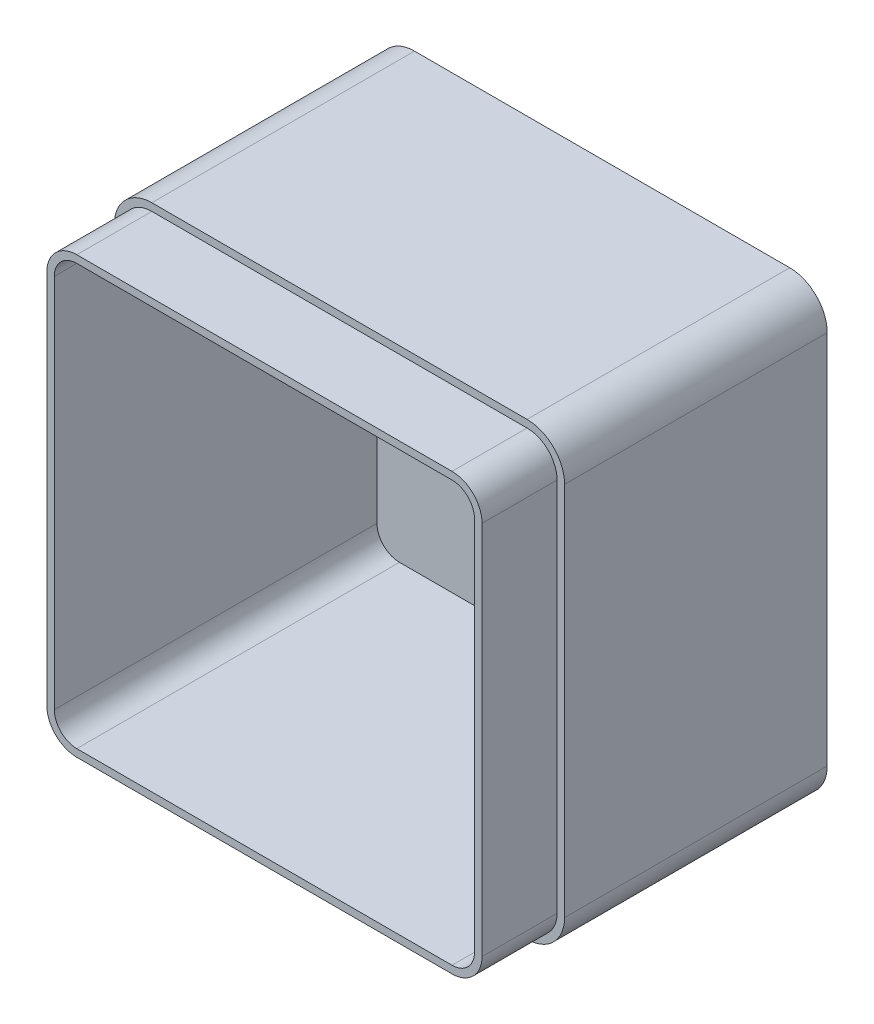
ISO-10303-21;
HEADER;
FILE_DESCRIPTION(('STEP AP214'),'2;1');
FILE_NAME('part.step','',(''),(''),'','','');
FILE_SCHEMA(('AUTOMOTIVE_DESIGN { 1 0 10303 214 1 1 1 1 }'));
ENDSEC;
DATA;
#1=APPLICATION_CONTEXT('core data for automotive mechanical design processes');
#2=APPLICATION_PROTOCOL_DEFINITION('international standard','automotive_design',2000,#1);
#3=PRODUCT_CONTEXT('',#1,'mechanical');
#4=PRODUCT('Part','Part','',(#3));
#5=PRODUCT_RELATED_PRODUCT_CATEGORY('part','',(#4));
#6=PRODUCT_DEFINITION_FORMATION('','',#4);
#7=PRODUCT_DEFINITION_CONTEXT('part definition',#1,'design');
#8=PRODUCT_DEFINITION('design','',#6,#7);
#9=PRODUCT_DEFINITION_SHAPE('','',#8);
#10=(LENGTH_UNIT() NAMED_UNIT(*) SI_UNIT(.MILLI.,.METRE.));
#11=(NAMED_UNIT(*) PLANE_ANGLE_UNIT() SI_UNIT($,.RADIAN.));
#12=(NAMED_UNIT(*) SI_UNIT($,.STERADIAN.) SOLID_ANGLE_UNIT());
#13=UNCERTAINTY_MEASURE_WITH_UNIT(LENGTH_MEASURE(1.E-05),#10,'distance_accuracy_value','');
#14=(GEOMETRIC_REPRESENTATION_CONTEXT(3) GLOBAL_UNCERTAINTY_ASSIGNED_CONTEXT((#13)) GLOBAL_UNIT_ASSIGNED_CONTEXT((#10,
#11,#12)) REPRESENTATION_CONTEXT('',''));
#15=CARTESIAN_POINT('',(0.,0.,0.));
#16=DIRECTION('',(0.,0.,1.));
#17=DIRECTION('',(1.,0.,0.));
#18=AXIS2_PLACEMENT_3D('',#15,#16,#17);
#19=CARTESIAN_POINT('',(0.,0.,90.));
#20=DIRECTION('',(0.,0.,-1.));
#21=DIRECTION('',(-1.,0.,0.));
#22=AXIS2_PLACEMENT_3D('',#19,#20,#21);
#23=PLANE('',#22);
#24=DIRECTION('',(0.,-1.,0.));
#25=VECTOR('',#24,1.);
#26=CARTESIAN_POINT('',(4.,0.,90.));
#27=LINE('',#26,#25);
#28=CARTESIAN_POINT('',(4.,110.,90.));
#29=VERTEX_POINT('',#28);
#30=CARTESIAN_POINT('',(4.,9.99999999999999,90.));
#31=VERTEX_POINT('',#30);
#32=EDGE_CURVE('E304',#29,#31,#27,.T.);
#33=ORIENTED_EDGE('',*,*,#32,.F.);
#34=CARTESIAN_POINT('',(10.,110.,90.));
#35=DIRECTION('',(0.,0.,-1.));
#36=DIRECTION('',(-1.,0.,0.));
#37=AXIS2_PLACEMENT_3D('',#34,#35,#36);
#38=CIRCLE('',#37,6.);
#39=CARTESIAN_POINT('',(9.99999999999999,116.,90.));
#40=VERTEX_POINT('',#39);
#41=EDGE_CURVE('E287',#40,#29,#38,.F.);
#42=ORIENTED_EDGE('',*,*,#41,.F.);
#43=DIRECTION('',(-1.,0.,0.));
#44=VECTOR('',#43,1.);
#45=CARTESIAN_POINT('',(0.,116.,90.));
#46=LINE('',#45,#44);
#47=CARTESIAN_POINT('',(110.,116.,90.));
#48=VERTEX_POINT('',#47);
#49=EDGE_CURVE('E313',#48,#40,#46,.T.);
#50=ORIENTED_EDGE('',*,*,#49,.F.);
#51=CARTESIAN_POINT('',(110.,110.,90.));
#52=DIRECTION('',(0.,0.,-1.));
#53=DIRECTION('',(-1.,0.,0.));
#54=AXIS2_PLACEMENT_3D('',#51,#52,#53);
#55=CIRCLE('',#54,6.);
#56=CARTESIAN_POINT('',(116.,110.,90.));
#57=VERTEX_POINT('',#56);
#58=EDGE_CURVE('E336',#57,#48,#55,.F.);
#59=ORIENTED_EDGE('',*,*,#58,.F.);
#60=DIRECTION('',(0.,1.,0.));
#61=VECTOR('',#60,1.);
#62=CARTESIAN_POINT('',(116.,0.,90.));
#63=LINE('',#62,#61);
#64=CARTESIAN_POINT('',(116.,9.99999999999999,90.));
#65=VERTEX_POINT('',#64);
#66=EDGE_CURVE('E334',#65,#57,#63,.T.);
#67=ORIENTED_EDGE('',*,*,#66,.F.);
#68=CARTESIAN_POINT('',(110.,10.,90.));
#69=DIRECTION('',(0.,0.,-1.));
#70=DIRECTION('',(-1.,0.,0.));
#71=AXIS2_PLACEMENT_3D('',#68,#69,#70);
#72=CIRCLE('',#71,6.);
#73=CARTESIAN_POINT('',(110.,4.,90.));
#74=VERTEX_POINT('',#73);
#75=EDGE_CURVE('E331',#74,#65,#72,.F.);
#76=ORIENTED_EDGE('',*,*,#75,.F.);
#77=DIRECTION('',(1.,0.,0.));
#78=VECTOR('',#77,1.);
#79=CARTESIAN_POINT('',(0.,4.,90.));
#80=LINE('',#79,#78);
#81=CARTESIAN_POINT('',(9.99999999999999,4.,90.));
#82=VERTEX_POINT('',#81);
#83=EDGE_CURVE('E329',#82,#74,#80,.T.);
#84=ORIENTED_EDGE('',*,*,#83,.F.);
#85=CARTESIAN_POINT('',(10.,10.,90.));
#86=DIRECTION('',(0.,0.,-1.));
#87=DIRECTION('',(-1.,0.,0.));
#88=AXIS2_PLACEMENT_3D('',#85,#86,#87);
#89=CIRCLE('',#88,6.);
#90=EDGE_CURVE('E320',#31,#82,#89,.F.);
#91=ORIENTED_EDGE('',*,*,#90,.F.);
#92=EDGE_LOOP('',(#33,#42,#50,#59,#67,#76,#84,#91));
#93=FACE_BOUND('',#92,.T.);
#94=CARTESIAN_POINT('',(10.,110.,90.));
#95=DIRECTION('',(0.,0.,1.));
#96=DIRECTION('',(1.,0.,0.));
#97=AXIS2_PLACEMENT_3D('',#94,#95,#96);
#98=CIRCLE('',#97,8.);
#99=CARTESIAN_POINT('',(9.99999999999999,118.,90.));
#100=VERTEX_POINT('',#99);
#101=CARTESIAN_POINT('',(2.,110.,90.));
#102=VERTEX_POINT('',#101);
#103=EDGE_CURVE('E239',#100,#102,#98,.T.);
#104=ORIENTED_EDGE('',*,*,#103,.T.);
#105=DIRECTION('',(0.,-1.,0.));
#106=VECTOR('',#105,1.);
#107=CARTESIAN_POINT('',(2.,110.,90.));
#108=LINE('',#107,#106);
#109=CARTESIAN_POINT('',(2.,9.99999999999999,90.));
#110=VERTEX_POINT('',#109);
#111=EDGE_CURVE('E199',#102,#110,#108,.T.);
#112=ORIENTED_EDGE('',*,*,#111,.T.);
#113=CARTESIAN_POINT('',(10.,10.,90.));
#114=DIRECTION('',(0.,0.,1.));
#115=DIRECTION('',(1.,0.,0.));
#116=AXIS2_PLACEMENT_3D('',#113,#114,#115);
#117=CIRCLE('',#116,8.);
#118=CARTESIAN_POINT('',(9.99999999999999,2.,90.));
#119=VERTEX_POINT('',#118);
#120=EDGE_CURVE('E48',#110,#119,#117,.T.);
#121=ORIENTED_EDGE('',*,*,#120,.T.);
#122=DIRECTION('',(1.,0.,0.));
#123=VECTOR('',#122,1.);
#124=CARTESIAN_POINT('',(10.,2.,90.));
#125=LINE('',#124,#123);
#126=CARTESIAN_POINT('',(110.,2.,90.));
#127=VERTEX_POINT('',#126);
#128=EDGE_CURVE('E243',#119,#127,#125,.T.);
#129=ORIENTED_EDGE('',*,*,#128,.T.);
#130=CARTESIAN_POINT('',(110.,10.,90.));
#131=DIRECTION('',(0.,0.,1.));
#132=DIRECTION('',(1.,0.,0.));
#133=AXIS2_PLACEMENT_3D('',#130,#131,#132);
#134=CIRCLE('',#133,7.99999999999999);
#135=CARTESIAN_POINT('',(118.,10.,90.));
#136=VERTEX_POINT('',#135);
#137=EDGE_CURVE('E246',#127,#136,#134,.T.);
#138=ORIENTED_EDGE('',*,*,#137,.T.);
#139=DIRECTION('',(0.,1.,0.));
#140=VECTOR('',#139,1.);
#141=CARTESIAN_POINT('',(118.,10.,90.));
#142=LINE('',#141,#140);
#143=CARTESIAN_POINT('',(118.,110.,90.));
#144=VERTEX_POINT('',#143);
#145=EDGE_CURVE('E249',#136,#144,#142,.T.);
#146=ORIENTED_EDGE('',*,*,#145,.T.);
#147=CARTESIAN_POINT('',(110.,110.,90.));
#148=DIRECTION('',(0.,0.,1.));
#149=DIRECTION('',(1.,0.,0.));
#150=AXIS2_PLACEMENT_3D('',#147,#148,#149);
#151=CIRCLE('',#150,7.99999999999999);
#152=CARTESIAN_POINT('',(110.,118.,90.));
#153=VERTEX_POINT('',#152);
#154=EDGE_CURVE('E222',#144,#153,#151,.T.);
#155=ORIENTED_EDGE('',*,*,#154,.T.);
#156=DIRECTION('',(-1.,0.,0.));
#157=VECTOR('',#156,1.);
#158=CARTESIAN_POINT('',(110.,118.,90.));
#159=LINE('',#158,#157);
#160=EDGE_CURVE('E219',#153,#100,#159,.T.);
#161=ORIENTED_EDGE('',*,*,#160,.T.);
#162=EDGE_LOOP('',(#104,#112,#121,#129,#138,#146,#155,#161));
#163=FACE_BOUND('',#162,.T.);
#164=ADVANCED_FACE('F33',(#93,#163),#23,.F.);
#165=CARTESIAN_POINT('',(4.,0.,90.));
#166=DIRECTION('',(1.,0.,0.));
#167=DIRECTION('',(0.,0.,-1.));
#168=AXIS2_PLACEMENT_3D('',#165,#166,#167);
#169=PLANE('',#168);
#170=DIRECTION('',(0.,-1.,0.));
#171=VECTOR('',#170,1.);
#172=CARTESIAN_POINT('',(4.,0.,4.));
#173=LINE('',#172,#171);
#174=CARTESIAN_POINT('',(4.,110.,4.));
#175=VERTEX_POINT('',#174);
#176=CARTESIAN_POINT('',(4.,9.99999999999999,4.));
#177=VERTEX_POINT('',#176);
#178=EDGE_CURVE('E281',#175,#177,#173,.T.);
#179=ORIENTED_EDGE('',*,*,#178,.F.);
#180=DIRECTION('',(0.,0.,-1.));
#181=VECTOR('',#180,1.);
#182=CARTESIAN_POINT('',(4.,110.,90.));
#183=LINE('',#182,#181);
#184=EDGE_CURVE('E288',#29,#175,#183,.T.);
#185=ORIENTED_EDGE('',*,*,#184,.F.);
#186=ORIENTED_EDGE('',*,*,#32,.T.);
#187=DIRECTION('',(0.,0.,-1.));
#188=VECTOR('',#187,1.);
#189=CARTESIAN_POINT('',(4.,9.99999999999999,90.));
#190=LINE('',#189,#188);
#191=EDGE_CURVE('E285',#177,#31,#190,.F.);
#192=ORIENTED_EDGE('',*,*,#191,.F.);
#193=EDGE_LOOP('',(#179,#185,#186,#192));
#194=FACE_BOUND('',#193,.T.);
#195=ADVANCED_FACE('F427',(#194),#169,.T.);
#196=CARTESIAN_POINT('',(0.,4.,90.));
#197=DIRECTION('',(0.,1.,0.));
#198=DIRECTION('',(0.,0.,1.));
#199=AXIS2_PLACEMENT_3D('',#196,#197,#198);
#200=PLANE('',#199);
#201=ORIENTED_EDGE('',*,*,#83,.T.);
#202=DIRECTION('',(0.,0.,1.));
#203=VECTOR('',#202,1.);
#204=CARTESIAN_POINT('',(110.,4.,90.));
#205=LINE('',#204,#203);
#206=CARTESIAN_POINT('',(110.,4.,4.));
#207=VERTEX_POINT('',#206);
#208=EDGE_CURVE('E311',#207,#74,#205,.T.);
#209=ORIENTED_EDGE('',*,*,#208,.F.);
#210=DIRECTION('',(1.,0.,0.));
#211=VECTOR('',#210,1.);
#212=CARTESIAN_POINT('',(0.,4.,4.));
#213=LINE('',#212,#211);
#214=CARTESIAN_POINT('',(9.99999999999999,4.,4.));
#215=VERTEX_POINT('',#214);
#216=EDGE_CURVE('E284',#215,#207,#213,.T.);
#217=ORIENTED_EDGE('',*,*,#216,.F.);
#218=DIRECTION('',(0.,0.,1.));
#219=VECTOR('',#218,1.);
#220=CARTESIAN_POINT('',(9.99999999999999,4.,90.));
#221=LINE('',#220,#219);
#222=EDGE_CURVE('E300',#82,#215,#221,.F.);
#223=ORIENTED_EDGE('',*,*,#222,.F.);
#224=EDGE_LOOP('',(#201,#209,#217,#223));
#225=FACE_BOUND('',#224,.T.);
#226=ADVANCED_FACE('F433',(#225),#200,.T.);
#227=CARTESIAN_POINT('',(116.,0.,90.));
#228=DIRECTION('',(-1.,0.,0.));
#229=DIRECTION('',(0.,0.,1.));
#230=AXIS2_PLACEMENT_3D('',#227,#228,#229);
#231=PLANE('',#230);
#232=ORIENTED_EDGE('',*,*,#66,.T.);
#233=DIRECTION('',(0.,0.,1.));
#234=VECTOR('',#233,1.);
#235=CARTESIAN_POINT('',(116.,110.,90.));
#236=LINE('',#235,#234);
#237=CARTESIAN_POINT('',(116.,110.,4.));
#238=VERTEX_POINT('',#237);
#239=EDGE_CURVE('E318',#238,#57,#236,.T.);
#240=ORIENTED_EDGE('',*,*,#239,.F.);
#241=DIRECTION('',(0.,1.,0.));
#242=VECTOR('',#241,1.);
#243=CARTESIAN_POINT('',(116.,0.,4.));
#244=LINE('',#243,#242);
#245=CARTESIAN_POINT('',(116.,9.99999999999999,4.));
#246=VERTEX_POINT('',#245);
#247=EDGE_CURVE('E294',#246,#238,#244,.T.);
#248=ORIENTED_EDGE('',*,*,#247,.F.);
#249=DIRECTION('',(0.,0.,1.));
#250=VECTOR('',#249,1.);
#251=CARTESIAN_POINT('',(116.,9.99999999999999,90.));
#252=LINE('',#251,#250);
#253=EDGE_CURVE('E314',#65,#246,#252,.F.);
#254=ORIENTED_EDGE('',*,*,#253,.F.);
#255=EDGE_LOOP('',(#232,#240,#248,#254));
#256=FACE_BOUND('',#255,.T.);
#257=ADVANCED_FACE('F462',(#256),#231,.T.);
#258=CARTESIAN_POINT('',(0.,116.,90.));
#259=DIRECTION('',(0.,-1.,0.));
#260=DIRECTION('',(0.,0.,-1.));
#261=AXIS2_PLACEMENT_3D('',#258,#259,#260);
#262=PLANE('',#261);
#263=ORIENTED_EDGE('',*,*,#49,.T.);
#264=DIRECTION('',(0.,0.,-1.));
#265=VECTOR('',#264,1.);
#266=CARTESIAN_POINT('',(9.99999999999999,116.,90.));
#267=LINE('',#266,#265);
#268=CARTESIAN_POINT('',(9.99999999999999,116.,4.));
#269=VERTEX_POINT('',#268);
#270=EDGE_CURVE('E317',#269,#40,#267,.F.);
#271=ORIENTED_EDGE('',*,*,#270,.F.);
#272=DIRECTION('',(-1.,0.,0.));
#273=VECTOR('',#272,1.);
#274=CARTESIAN_POINT('',(0.,116.,4.));
#275=LINE('',#274,#273);
#276=CARTESIAN_POINT('',(110.,116.,4.));
#277=VERTEX_POINT('',#276);
#278=EDGE_CURVE('E301',#277,#269,#275,.T.);
#279=ORIENTED_EDGE('',*,*,#278,.F.);
#280=DIRECTION('',(0.,0.,-1.));
#281=VECTOR('',#280,1.);
#282=CARTESIAN_POINT('',(110.,116.,90.));
#283=LINE('',#282,#281);
#284=EDGE_CURVE('E321',#48,#277,#283,.T.);
#285=ORIENTED_EDGE('',*,*,#284,.F.);
#286=EDGE_LOOP('',(#263,#271,#279,#285));
#287=FACE_BOUND('',#286,.T.);
#288=ADVANCED_FACE('F458',(#287),#262,.T.);
#289=CARTESIAN_POINT('',(0.,0.,4.));
#290=DIRECTION('',(0.,0.,-1.));
#291=DIRECTION('',(-1.,0.,0.));
#292=AXIS2_PLACEMENT_3D('',#289,#290,#291);
#293=PLANE('',#292);
#294=ORIENTED_EDGE('',*,*,#216,.T.);
#295=CARTESIAN_POINT('',(110.,10.,4.));
#296=DIRECTION('',(0.,0.,-1.));
#297=DIRECTION('',(-1.,0.,0.));
#298=AXIS2_PLACEMENT_3D('',#295,#296,#297);
#299=CIRCLE('',#298,6.);
#300=EDGE_CURVE('E296',#246,#207,#299,.T.);
#301=ORIENTED_EDGE('',*,*,#300,.F.);
#302=ORIENTED_EDGE('',*,*,#247,.T.);
#303=CARTESIAN_POINT('',(110.,110.,4.));
#304=DIRECTION('',(0.,0.,-1.));
#305=DIRECTION('',(-1.,0.,0.));
#306=AXIS2_PLACEMENT_3D('',#303,#304,#305);
#307=CIRCLE('',#306,6.);
#308=EDGE_CURVE('E299',#277,#238,#307,.T.);
#309=ORIENTED_EDGE('',*,*,#308,.F.);
#310=ORIENTED_EDGE('',*,*,#278,.T.);
#311=CARTESIAN_POINT('',(10.,110.,4.));
#312=DIRECTION('',(0.,0.,-1.));
#313=DIRECTION('',(-1.,0.,0.));
#314=AXIS2_PLACEMENT_3D('',#311,#312,#313);
#315=CIRCLE('',#314,6.);
#316=EDGE_CURVE('E297',#175,#269,#315,.T.);
#317=ORIENTED_EDGE('',*,*,#316,.F.);
#318=ORIENTED_EDGE('',*,*,#178,.T.);
#319=CARTESIAN_POINT('',(10.,10.,4.));
#320=DIRECTION('',(0.,0.,-1.));
#321=DIRECTION('',(-1.,0.,0.));
#322=AXIS2_PLACEMENT_3D('',#319,#320,#321);
#323=CIRCLE('',#322,6.);
#324=EDGE_CURVE('E291',#215,#177,#323,.T.);
#325=ORIENTED_EDGE('',*,*,#324,.F.);
#326=EDGE_LOOP('',(#294,#301,#302,#309,#310,#317,#318,#325));
#327=FACE_BOUND('',#326,.T.);
#328=ADVANCED_FACE('F454',(#327),#293,.F.);
#329=CARTESIAN_POINT('',(10.,10.,90.));
#330=DIRECTION('',(0.,0.,-1.));
#331=DIRECTION('',(-1.,0.,0.));
#332=AXIS2_PLACEMENT_3D('',#329,#330,#331);
#333=CYLINDRICAL_SURFACE('',#332,6.);
#334=ORIENTED_EDGE('',*,*,#90,.T.);
#335=ORIENTED_EDGE('',*,*,#222,.T.);
#336=ORIENTED_EDGE('',*,*,#324,.T.);
#337=ORIENTED_EDGE('',*,*,#191,.T.);
#338=EDGE_LOOP('',(#334,#335,#336,#337));
#339=FACE_BOUND('',#338,.T.);
#340=ADVANCED_FACE('F450',(#339),#333,.F.);
#341=CARTESIAN_POINT('',(110.,10.,90.));
#342=DIRECTION('',(0.,0.,-1.));
#343=DIRECTION('',(-1.,0.,0.));
#344=AXIS2_PLACEMENT_3D('',#341,#342,#343);
#345=CYLINDRICAL_SURFACE('',#344,6.);
#346=ORIENTED_EDGE('',*,*,#75,.T.);
#347=ORIENTED_EDGE('',*,*,#253,.T.);
#348=ORIENTED_EDGE('',*,*,#300,.T.);
#349=ORIENTED_EDGE('',*,*,#208,.T.);
#350=EDGE_LOOP('',(#346,#347,#348,#349));
#351=FACE_BOUND('',#350,.T.);
#352=ADVANCED_FACE('F446',(#351),#345,.F.);
#353=CARTESIAN_POINT('',(110.,110.,90.));
#354=DIRECTION('',(0.,0.,-1.));
#355=DIRECTION('',(-1.,0.,0.));
#356=AXIS2_PLACEMENT_3D('',#353,#354,#355);
#357=CYLINDRICAL_SURFACE('',#356,6.);
#358=ORIENTED_EDGE('',*,*,#58,.T.);
#359=ORIENTED_EDGE('',*,*,#284,.T.);
#360=ORIENTED_EDGE('',*,*,#308,.T.);
#361=ORIENTED_EDGE('',*,*,#239,.T.);
#362=EDGE_LOOP('',(#358,#359,#360,#361));
#363=FACE_BOUND('',#362,.T.);
#364=ADVANCED_FACE('F442',(#363),#357,.F.);
#365=CARTESIAN_POINT('',(10.,110.,90.));
#366=DIRECTION('',(0.,0.,-1.));
#367=DIRECTION('',(-1.,0.,0.));
#368=AXIS2_PLACEMENT_3D('',#365,#366,#367);
#369=CYLINDRICAL_SURFACE('',#368,6.);
#370=ORIENTED_EDGE('',*,*,#41,.T.);
#371=ORIENTED_EDGE('',*,*,#184,.T.);
#372=ORIENTED_EDGE('',*,*,#316,.T.);
#373=ORIENTED_EDGE('',*,*,#270,.T.);
#374=EDGE_LOOP('',(#370,#371,#372,#373));
#375=FACE_BOUND('',#374,.T.);
#376=ADVANCED_FACE('F439',(#375),#369,.F.);
#377=CARTESIAN_POINT('',(10.,110.,70.));
#378=DIRECTION('',(0.,0.,1.));
#379=DIRECTION('',(1.,0.,0.));
#380=AXIS2_PLACEMENT_3D('',#377,#378,#379);
#381=PLANE('',#380);
#382=DIRECTION('',(-1.,0.,0.));
#383=VECTOR('',#382,1.);
#384=CARTESIAN_POINT('',(110.,118.,70.));
#385=LINE('',#384,#383);
#386=CARTESIAN_POINT('',(110.,118.,70.));
#387=VERTEX_POINT('',#386);
#388=CARTESIAN_POINT('',(9.99999999999999,118.,70.));
#389=VERTEX_POINT('',#388);
#390=EDGE_CURVE('E205',#387,#389,#385,.T.);
#391=ORIENTED_EDGE('',*,*,#390,.F.);
#392=CARTESIAN_POINT('',(110.,110.,70.));
#393=DIRECTION('',(0.,0.,1.));
#394=DIRECTION('',(1.,0.,0.));
#395=AXIS2_PLACEMENT_3D('',#392,#393,#394);
#396=CIRCLE('',#395,7.99999999999999);
#397=CARTESIAN_POINT('',(118.,110.,70.));
#398=VERTEX_POINT('',#397);
#399=EDGE_CURVE('E235',#398,#387,#396,.T.);
#400=ORIENTED_EDGE('',*,*,#399,.F.);
#401=DIRECTION('',(0.,1.,0.));
#402=VECTOR('',#401,1.);
#403=CARTESIAN_POINT('',(118.,10.,70.));
#404=LINE('',#403,#402);
#405=CARTESIAN_POINT('',(118.,10.,70.));
#406=VERTEX_POINT('',#405);
#407=EDGE_CURVE('E232',#406,#398,#404,.T.);
#408=ORIENTED_EDGE('',*,*,#407,.F.);
#409=CARTESIAN_POINT('',(110.,10.,70.));
#410=DIRECTION('',(0.,0.,1.));
#411=DIRECTION('',(1.,0.,0.));
#412=AXIS2_PLACEMENT_3D('',#409,#410,#411);
#413=CIRCLE('',#412,7.99999999999999);
#414=CARTESIAN_POINT('',(110.,2.,70.));
#415=VERTEX_POINT('',#414);
#416=EDGE_CURVE('E229',#415,#406,#413,.T.);
#417=ORIENTED_EDGE('',*,*,#416,.F.);
#418=DIRECTION('',(1.,0.,0.));
#419=VECTOR('',#418,1.);
#420=CARTESIAN_POINT('',(10.,2.,70.));
#421=LINE('',#420,#419);
#422=CARTESIAN_POINT('',(9.99999999999999,2.,70.));
#423=VERTEX_POINT('',#422);
#424=EDGE_CURVE('E226',#423,#415,#421,.T.);
#425=ORIENTED_EDGE('',*,*,#424,.F.);
#426=CARTESIAN_POINT('',(10.,10.,70.));
#427=DIRECTION('',(0.,0.,1.));
#428=DIRECTION('',(1.,0.,0.));
#429=AXIS2_PLACEMENT_3D('',#426,#427,#428);
#430=CIRCLE('',#429,8.);
#431=CARTESIAN_POINT('',(2.,9.99999999999999,70.));
#432=VERTEX_POINT('',#431);
#433=EDGE_CURVE('E215',#432,#423,#430,.T.);
#434=ORIENTED_EDGE('',*,*,#433,.F.);
#435=DIRECTION('',(0.,-1.,0.));
#436=VECTOR('',#435,1.);
#437=CARTESIAN_POINT('',(2.,110.,70.));
#438=LINE('',#437,#436);
#439=CARTESIAN_POINT('',(2.,110.,70.));
#440=VERTEX_POINT('',#439);
#441=EDGE_CURVE('E197',#440,#432,#438,.T.);
#442=ORIENTED_EDGE('',*,*,#441,.F.);
#443=CARTESIAN_POINT('',(10.,110.,70.));
#444=DIRECTION('',(0.,0.,1.));
#445=DIRECTION('',(1.,0.,0.));
#446=AXIS2_PLACEMENT_3D('',#443,#444,#445);
#447=CIRCLE('',#446,8.);
#448=EDGE_CURVE('E211',#389,#440,#447,.T.);
#449=ORIENTED_EDGE('',*,*,#448,.F.);
#450=EDGE_LOOP('',(#391,#400,#408,#417,#425,#434,#442,#449));
#451=FACE_BOUND('',#450,.T.);
#452=CARTESIAN_POINT('',(10.,110.,70.));
#453=DIRECTION('',(0.,0.,1.));
#454=DIRECTION('',(1.,0.,0.));
#455=AXIS2_PLACEMENT_3D('',#452,#453,#454);
#456=CIRCLE('',#455,10.);
#457=CARTESIAN_POINT('',(10.,120.,70.));
#458=VERTEX_POINT('',#457);
#459=CARTESIAN_POINT('',(0.,110.,70.));
#460=VERTEX_POINT('',#459);
#461=EDGE_CURVE('E255',#458,#460,#456,.T.);
#462=ORIENTED_EDGE('',*,*,#461,.T.);
#463=DIRECTION('',(0.,-1.,0.));
#464=VECTOR('',#463,1.);
#465=CARTESIAN_POINT('',(0.,110.,70.));
#466=LINE('',#465,#464);
#467=CARTESIAN_POINT('',(0.,10.,70.));
#468=VERTEX_POINT('',#467);
#469=EDGE_CURVE('E268',#460,#468,#466,.T.);
#470=ORIENTED_EDGE('',*,*,#469,.T.);
#471=CARTESIAN_POINT('',(10.,10.,70.));
#472=DIRECTION('',(0.,0.,1.));
#473=DIRECTION('',(1.,0.,0.));
#474=AXIS2_PLACEMENT_3D('',#471,#472,#473);
#475=CIRCLE('',#474,10.);
#476=CARTESIAN_POINT('',(9.99999999999999,0.,70.));
#477=VERTEX_POINT('',#476);
#478=EDGE_CURVE('E270',#468,#477,#475,.T.);
#479=ORIENTED_EDGE('',*,*,#478,.T.);
#480=DIRECTION('',(1.,0.,0.));
#481=VECTOR('',#480,1.);
#482=CARTESIAN_POINT('',(9.99999999999999,0.,70.));
#483=LINE('',#482,#481);
#484=CARTESIAN_POINT('',(110.,0.,70.));
#485=VERTEX_POINT('',#484);
#486=EDGE_CURVE('E272',#477,#485,#483,.T.);
#487=ORIENTED_EDGE('',*,*,#486,.T.);
#488=CARTESIAN_POINT('',(110.,10.,70.));
#489=DIRECTION('',(0.,0.,1.));
#490=DIRECTION('',(1.,0.,0.));
#491=AXIS2_PLACEMENT_3D('',#488,#489,#490);
#492=CIRCLE('',#491,9.99999999999999);
#493=CARTESIAN_POINT('',(120.,10.,70.));
#494=VERTEX_POINT('',#493);
#495=EDGE_CURVE('E274',#485,#494,#492,.T.);
#496=ORIENTED_EDGE('',*,*,#495,.T.);
#497=DIRECTION('',(0.,1.,0.));
#498=VECTOR('',#497,1.);
#499=CARTESIAN_POINT('',(120.,10.,70.));
#500=LINE('',#499,#498);
#501=CARTESIAN_POINT('',(120.,110.,70.));
#502=VERTEX_POINT('',#501);
#503=EDGE_CURVE('E276',#494,#502,#500,.T.);
#504=ORIENTED_EDGE('',*,*,#503,.T.);
#505=CARTESIAN_POINT('',(110.,110.,70.));
#506=DIRECTION('',(0.,0.,1.));
#507=DIRECTION('',(1.,0.,0.));
#508=AXIS2_PLACEMENT_3D('',#505,#506,#507);
#509=CIRCLE('',#508,9.99999999999999);
#510=CARTESIAN_POINT('',(110.,120.,70.));
#511=VERTEX_POINT('',#510);
#512=EDGE_CURVE('E278',#502,#511,#509,.T.);
#513=ORIENTED_EDGE('',*,*,#512,.T.);
#514=DIRECTION('',(-1.,0.,0.));
#515=VECTOR('',#514,1.);
#516=CARTESIAN_POINT('',(110.,120.,70.));
#517=LINE('',#516,#515);
#518=EDGE_CURVE('E56',#511,#458,#517,.T.);
#519=ORIENTED_EDGE('',*,*,#518,.T.);
#520=EDGE_LOOP('',(#462,#470,#479,#487,#496,#504,#513,#519));
#521=FACE_BOUND('',#520,.T.);
#522=ADVANCED_FACE('F210',(#451,#521),#381,.T.);
#523=CARTESIAN_POINT('',(10.,110.,70.));
#524=DIRECTION('',(0.,0.,1.));
#525=DIRECTION('',(1.,0.,0.));
#526=AXIS2_PLACEMENT_3D('',#523,#524,#525);
#527=CYLINDRICAL_SURFACE('',#526,8.);
#528=ORIENTED_EDGE('',*,*,#103,.F.);
#529=DIRECTION('',(0.,0.,1.));
#530=VECTOR('',#529,1.);
#531=CARTESIAN_POINT('',(9.99999999999999,118.,70.));
#532=LINE('',#531,#530);
#533=EDGE_CURVE('E218',#389,#100,#532,.T.);
#534=ORIENTED_EDGE('',*,*,#533,.F.);
#535=ORIENTED_EDGE('',*,*,#448,.T.);
#536=DIRECTION('',(0.,0.,1.));
#537=VECTOR('',#536,1.);
#538=CARTESIAN_POINT('',(2.,110.,70.));
#539=LINE('',#538,#537);
#540=EDGE_CURVE('E194',#440,#102,#539,.T.);
#541=ORIENTED_EDGE('',*,*,#540,.T.);
#542=EDGE_LOOP('',(#528,#534,#535,#541));
#543=FACE_BOUND('',#542,.T.);
#544=ADVANCED_FACE('F217',(#543),#527,.T.);
#545=CARTESIAN_POINT('',(110.,118.,70.));
#546=DIRECTION('',(0.,1.,0.));
#547=DIRECTION('',(0.,0.,1.));
#548=AXIS2_PLACEMENT_3D('',#545,#546,#547);
#549=PLANE('',#548);
#550=ORIENTED_EDGE('',*,*,#160,.F.);
#551=DIRECTION('',(0.,0.,1.));
#552=VECTOR('',#551,1.);
#553=CARTESIAN_POINT('',(110.,118.,70.));
#554=LINE('',#553,#552);
#555=EDGE_CURVE('E256',#387,#153,#554,.T.);
#556=ORIENTED_EDGE('',*,*,#555,.F.);
#557=ORIENTED_EDGE('',*,*,#390,.T.);
#558=ORIENTED_EDGE('',*,*,#533,.T.);
#559=EDGE_LOOP('',(#550,#556,#557,#558));
#560=FACE_BOUND('',#559,.T.);
#561=ADVANCED_FACE('F473',(#560),#549,.T.);
#562=CARTESIAN_POINT('',(110.,110.,70.));
#563=DIRECTION('',(0.,0.,1.));
#564=DIRECTION('',(1.,0.,0.));
#565=AXIS2_PLACEMENT_3D('',#562,#563,#564);
#566=CYLINDRICAL_SURFACE('',#565,7.99999999999999);
#567=ORIENTED_EDGE('',*,*,#154,.F.);
#568=DIRECTION('',(0.,0.,1.));
#569=VECTOR('',#568,1.);
#570=CARTESIAN_POINT('',(118.,110.,70.));
#571=LINE('',#570,#569);
#572=EDGE_CURVE('E258',#398,#144,#571,.T.);
#573=ORIENTED_EDGE('',*,*,#572,.F.);
#574=ORIENTED_EDGE('',*,*,#399,.T.);
#575=ORIENTED_EDGE('',*,*,#555,.T.);
#576=EDGE_LOOP('',(#567,#573,#574,#575));
#577=FACE_BOUND('',#576,.T.);
#578=ADVANCED_FACE('F488',(#577),#566,.T.);
#579=CARTESIAN_POINT('',(118.,10.,70.));
#580=DIRECTION('',(1.,0.,0.));
#581=DIRECTION('',(0.,0.,-1.));
#582=AXIS2_PLACEMENT_3D('',#579,#580,#581);
#583=PLANE('',#582);
#584=ORIENTED_EDGE('',*,*,#145,.F.);
#585=DIRECTION('',(0.,0.,1.));
#586=VECTOR('',#585,1.);
#587=CARTESIAN_POINT('',(118.,10.,70.));
#588=LINE('',#587,#586);
#589=EDGE_CURVE('E260',#406,#136,#588,.T.);
#590=ORIENTED_EDGE('',*,*,#589,.F.);
#591=ORIENTED_EDGE('',*,*,#407,.T.);
#592=ORIENTED_EDGE('',*,*,#572,.T.);
#593=EDGE_LOOP('',(#584,#590,#591,#592));
#594=FACE_BOUND('',#593,.T.);
#595=ADVANCED_FACE('F484',(#594),#583,.T.);
#596=CARTESIAN_POINT('',(110.,10.,70.));
#597=DIRECTION('',(0.,0.,1.));
#598=DIRECTION('',(1.,0.,0.));
#599=AXIS2_PLACEMENT_3D('',#596,#597,#598);
#600=CYLINDRICAL_SURFACE('',#599,7.99999999999999);
#601=ORIENTED_EDGE('',*,*,#137,.F.);
#602=DIRECTION('',(0.,0.,1.));
#603=VECTOR('',#602,1.);
#604=CARTESIAN_POINT('',(110.,2.,70.));
#605=LINE('',#604,#603);
#606=EDGE_CURVE('E262',#415,#127,#605,.T.);
#607=ORIENTED_EDGE('',*,*,#606,.F.);
#608=ORIENTED_EDGE('',*,*,#416,.T.);
#609=ORIENTED_EDGE('',*,*,#589,.T.);
#610=EDGE_LOOP('',(#601,#607,#608,#609));
#611=FACE_BOUND('',#610,.T.);
#612=ADVANCED_FACE('F480',(#611),#600,.T.);
#613=CARTESIAN_POINT('',(10.,2.,70.));
#614=DIRECTION('',(0.,-1.,0.));
#615=DIRECTION('',(0.,0.,-1.));
#616=AXIS2_PLACEMENT_3D('',#613,#614,#615);
#617=PLANE('',#616);
#618=ORIENTED_EDGE('',*,*,#128,.F.);
#619=DIRECTION('',(0.,0.,1.));
#620=VECTOR('',#619,1.);
#621=CARTESIAN_POINT('',(9.99999999999999,2.,70.));
#622=LINE('',#621,#620);
#623=EDGE_CURVE('E264',#423,#119,#622,.T.);
#624=ORIENTED_EDGE('',*,*,#623,.F.);
#625=ORIENTED_EDGE('',*,*,#424,.T.);
#626=ORIENTED_EDGE('',*,*,#606,.T.);
#627=EDGE_LOOP('',(#618,#624,#625,#626));
#628=FACE_BOUND('',#627,.T.);
#629=ADVANCED_FACE('F477',(#628),#617,.T.);
#630=CARTESIAN_POINT('',(10.,10.,70.));
#631=DIRECTION('',(0.,0.,1.));
#632=DIRECTION('',(1.,0.,0.));
#633=AXIS2_PLACEMENT_3D('',#630,#631,#632);
#634=CYLINDRICAL_SURFACE('',#633,8.);
#635=ORIENTED_EDGE('',*,*,#120,.F.);
#636=DIRECTION('',(0.,0.,1.));
#637=VECTOR('',#636,1.);
#638=CARTESIAN_POINT('',(2.,9.99999999999999,70.));
#639=LINE('',#638,#637);
#640=EDGE_CURVE('E204',#432,#110,#639,.T.);
#641=ORIENTED_EDGE('',*,*,#640,.F.);
#642=ORIENTED_EDGE('',*,*,#433,.T.);
#643=ORIENTED_EDGE('',*,*,#623,.T.);
#644=EDGE_LOOP('',(#635,#641,#642,#643));
#645=FACE_BOUND('',#644,.T.);
#646=ADVANCED_FACE('F422',(#645),#634,.T.);
#647=CARTESIAN_POINT('',(2.,110.,70.));
#648=DIRECTION('',(-1.,0.,0.));
#649=DIRECTION('',(0.,0.,1.));
#650=AXIS2_PLACEMENT_3D('',#647,#648,#649);
#651=PLANE('',#650);
#652=ORIENTED_EDGE('',*,*,#111,.F.);
#653=ORIENTED_EDGE('',*,*,#540,.F.);
#654=ORIENTED_EDGE('',*,*,#441,.T.);
#655=ORIENTED_EDGE('',*,*,#640,.T.);
#656=EDGE_LOOP('',(#652,#653,#654,#655));
#657=FACE_BOUND('',#656,.T.);
#658=ADVANCED_FACE('F196',(#657),#651,.T.);
#659=CARTESIAN_POINT('',(0.,0.,0.));
#660=DIRECTION('',(0.,0.,-1.));
#661=DIRECTION('',(-1.,0.,0.));
#662=AXIS2_PLACEMENT_3D('',#659,#660,#661);
#663=PLANE('',#662);
#664=DIRECTION('',(1.,0.,0.));
#665=VECTOR('',#664,1.);
#666=CARTESIAN_POINT('',(0.,0.,0.));
#667=LINE('',#666,#665);
#668=CARTESIAN_POINT('',(9.99999999999999,0.,0.));
#669=VERTEX_POINT('',#668);
#670=CARTESIAN_POINT('',(110.,0.,0.));
#671=VERTEX_POINT('',#670);
#672=EDGE_CURVE('E344',#669,#671,#667,.T.);
#673=ORIENTED_EDGE('',*,*,#672,.F.);
#674=CARTESIAN_POINT('',(10.,10.,0.));
#675=DIRECTION('',(0.,0.,-1.));
#676=DIRECTION('',(-1.,0.,0.));
#677=AXIS2_PLACEMENT_3D('',#674,#675,#676);
#678=CIRCLE('',#677,10.);
#679=CARTESIAN_POINT('',(0.,10.,0.));
#680=VERTEX_POINT('',#679);
#681=EDGE_CURVE('E364',#669,#680,#678,.T.);
#682=ORIENTED_EDGE('',*,*,#681,.T.);
#683=DIRECTION('',(0.,-1.,0.));
#684=VECTOR('',#683,1.);
#685=CARTESIAN_POINT('',(0.,0.,0.));
#686=LINE('',#685,#684);
#687=CARTESIAN_POINT('',(0.,110.,0.));
#688=VERTEX_POINT('',#687);
#689=EDGE_CURVE('E324',#688,#680,#686,.T.);
#690=ORIENTED_EDGE('',*,*,#689,.F.);
#691=CARTESIAN_POINT('',(10.,110.,0.));
#692=DIRECTION('',(0.,0.,-1.));
#693=DIRECTION('',(-1.,0.,0.));
#694=AXIS2_PLACEMENT_3D('',#691,#692,#693);
#695=CIRCLE('',#694,10.);
#696=CARTESIAN_POINT('',(9.99999999999999,120.,0.));
#697=VERTEX_POINT('',#696);
#698=EDGE_CURVE('E358',#688,#697,#695,.T.);
#699=ORIENTED_EDGE('',*,*,#698,.T.);
#700=DIRECTION('',(-1.,0.,0.));
#701=VECTOR('',#700,1.);
#702=CARTESIAN_POINT('',(0.,120.,0.));
#703=LINE('',#702,#701);
#704=CARTESIAN_POINT('',(110.,120.,0.));
#705=VERTEX_POINT('',#704);
#706=EDGE_CURVE('E350',#705,#697,#703,.T.);
#707=ORIENTED_EDGE('',*,*,#706,.F.);
#708=CARTESIAN_POINT('',(110.,110.,0.));
#709=DIRECTION('',(0.,0.,-1.));
#710=DIRECTION('',(-1.,0.,0.));
#711=AXIS2_PLACEMENT_3D('',#708,#709,#710);
#712=CIRCLE('',#711,10.);
#713=CARTESIAN_POINT('',(120.,110.,0.));
#714=VERTEX_POINT('',#713);
#715=EDGE_CURVE('E360',#705,#714,#712,.T.);
#716=ORIENTED_EDGE('',*,*,#715,.T.);
#717=DIRECTION('',(0.,1.,0.));
#718=VECTOR('',#717,1.);
#719=CARTESIAN_POINT('',(120.,0.,0.));
#720=LINE('',#719,#718);
#721=CARTESIAN_POINT('',(120.,10.,0.));
#722=VERTEX_POINT('',#721);
#723=EDGE_CURVE('E347',#722,#714,#720,.T.);
#724=ORIENTED_EDGE('',*,*,#723,.F.);
#725=CARTESIAN_POINT('',(110.,10.,0.));
#726=DIRECTION('',(0.,0.,-1.));
#727=DIRECTION('',(-1.,0.,0.));
#728=AXIS2_PLACEMENT_3D('',#725,#726,#727);
#729=CIRCLE('',#728,10.);
#730=EDGE_CURVE('E362',#722,#671,#729,.T.);
#731=ORIENTED_EDGE('',*,*,#730,.T.);
#732=EDGE_LOOP('',(#673,#682,#690,#699,#707,#716,#724,#731));
#733=FACE_BOUND('',#732,.T.);
#734=ADVANCED_FACE('F414',(#733),#663,.T.);
#735=CARTESIAN_POINT('',(10.,110.,90.));
#736=DIRECTION('',(0.,0.,-1.));
#737=DIRECTION('',(-1.,0.,0.));
#738=AXIS2_PLACEMENT_3D('',#735,#736,#737);
#739=CYLINDRICAL_SURFACE('',#738,10.);
#740=DIRECTION('',(0.,0.,-1.));
#741=VECTOR('',#740,1.);
#742=CARTESIAN_POINT('',(0.,110.,90.));
#743=LINE('',#742,#741);
#744=EDGE_CURVE('E366',#460,#688,#743,.T.);
#745=ORIENTED_EDGE('',*,*,#744,.F.);
#746=ORIENTED_EDGE('',*,*,#461,.F.);
#747=DIRECTION('',(0.,0.,-1.));
#748=VECTOR('',#747,1.);
#749=CARTESIAN_POINT('',(10.,120.,90.));
#750=LINE('',#749,#748);
#751=EDGE_CURVE('E41',#697,#458,#750,.F.);
#752=ORIENTED_EDGE('',*,*,#751,.F.);
#753=ORIENTED_EDGE('',*,*,#698,.F.);
#754=EDGE_LOOP('',(#745,#746,#752,#753));
#755=FACE_BOUND('',#754,.T.);
#756=ADVANCED_FACE('F35',(#755),#739,.T.);
#757=CARTESIAN_POINT('',(110.,110.,90.));
#758=DIRECTION('',(0.,0.,-1.));
#759=DIRECTION('',(-1.,0.,0.));
#760=AXIS2_PLACEMENT_3D('',#757,#758,#759);
#761=CYLINDRICAL_SURFACE('',#760,10.);
#762=DIRECTION('',(0.,0.,-1.));
#763=VECTOR('',#762,1.);
#764=CARTESIAN_POINT('',(110.,120.,90.));
#765=LINE('',#764,#763);
#766=EDGE_CURVE('E11',#511,#705,#765,.T.);
#767=ORIENTED_EDGE('',*,*,#766,.F.);
#768=ORIENTED_EDGE('',*,*,#512,.F.);
#769=DIRECTION('',(0.,0.,-1.));
#770=VECTOR('',#769,1.);
#771=CARTESIAN_POINT('',(120.,110.,90.));
#772=LINE('',#771,#770);
#773=EDGE_CURVE('E371',#714,#502,#772,.F.);
#774=ORIENTED_EDGE('',*,*,#773,.F.);
#775=ORIENTED_EDGE('',*,*,#715,.F.);
#776=EDGE_LOOP('',(#767,#768,#774,#775));
#777=FACE_BOUND('',#776,.T.);
#778=ADVANCED_FACE('F412',(#777),#761,.T.);
#779=CARTESIAN_POINT('',(0.,120.,90.));
#780=DIRECTION('',(0.,-1.,0.));
#781=DIRECTION('',(0.,0.,-1.));
#782=AXIS2_PLACEMENT_3D('',#779,#780,#781);
#783=PLANE('',#782);
#784=ORIENTED_EDGE('',*,*,#518,.F.);
#785=ORIENTED_EDGE('',*,*,#766,.T.);
#786=ORIENTED_EDGE('',*,*,#706,.T.);
#787=ORIENTED_EDGE('',*,*,#751,.T.);
#788=EDGE_LOOP('',(#784,#785,#786,#787));
#789=FACE_BOUND('',#788,.T.);
#790=ADVANCED_FACE('F378',(#789),#783,.F.);
#791=CARTESIAN_POINT('',(110.,10.,90.));
#792=DIRECTION('',(0.,0.,-1.));
#793=DIRECTION('',(-1.,0.,0.));
#794=AXIS2_PLACEMENT_3D('',#791,#792,#793);
#795=CYLINDRICAL_SURFACE('',#794,10.);
#796=DIRECTION('',(0.,0.,-1.));
#797=VECTOR('',#796,1.);
#798=CARTESIAN_POINT('',(120.,10.,90.));
#799=LINE('',#798,#797);
#800=EDGE_CURVE('E374',#494,#722,#799,.T.);
#801=ORIENTED_EDGE('',*,*,#800,.F.);
#802=ORIENTED_EDGE('',*,*,#495,.F.);
#803=DIRECTION('',(0.,0.,-1.));
#804=VECTOR('',#803,1.);
#805=CARTESIAN_POINT('',(110.,0.,90.));
#806=LINE('',#805,#804);
#807=EDGE_CURVE('E353',#671,#485,#806,.F.);
#808=ORIENTED_EDGE('',*,*,#807,.F.);
#809=ORIENTED_EDGE('',*,*,#730,.F.);
#810=EDGE_LOOP('',(#801,#802,#808,#809));
#811=FACE_BOUND('',#810,.T.);
#812=ADVANCED_FACE('F403',(#811),#795,.T.);
#813=CARTESIAN_POINT('',(120.,0.,90.));
#814=DIRECTION('',(-1.,0.,0.));
#815=DIRECTION('',(0.,0.,1.));
#816=AXIS2_PLACEMENT_3D('',#813,#814,#815);
#817=PLANE('',#816);
#818=ORIENTED_EDGE('',*,*,#503,.F.);
#819=ORIENTED_EDGE('',*,*,#800,.T.);
#820=ORIENTED_EDGE('',*,*,#723,.T.);
#821=ORIENTED_EDGE('',*,*,#773,.T.);
#822=EDGE_LOOP('',(#818,#819,#820,#821));
#823=FACE_BOUND('',#822,.T.);
#824=ADVANCED_FACE('F408',(#823),#817,.F.);
#825=CARTESIAN_POINT('',(10.,10.,90.));
#826=DIRECTION('',(0.,0.,-1.));
#827=DIRECTION('',(-1.,0.,0.));
#828=AXIS2_PLACEMENT_3D('',#825,#826,#827);
#829=CYLINDRICAL_SURFACE('',#828,10.);
#830=DIRECTION('',(0.,0.,-1.));
#831=VECTOR('',#830,1.);
#832=CARTESIAN_POINT('',(10.,0.,90.));
#833=LINE('',#832,#831);
#834=EDGE_CURVE('E356',#477,#669,#833,.T.);
#835=ORIENTED_EDGE('',*,*,#834,.F.);
#836=ORIENTED_EDGE('',*,*,#478,.F.);
#837=DIRECTION('',(0.,0.,-1.));
#838=VECTOR('',#837,1.);
#839=CARTESIAN_POINT('',(0.,10.,90.));
#840=LINE('',#839,#838);
#841=EDGE_CURVE('E368',#680,#468,#840,.F.);
#842=ORIENTED_EDGE('',*,*,#841,.F.);
#843=ORIENTED_EDGE('',*,*,#681,.F.);
#844=EDGE_LOOP('',(#835,#836,#842,#843));
#845=FACE_BOUND('',#844,.T.);
#846=ADVANCED_FACE('F393',(#845),#829,.T.);
#847=CARTESIAN_POINT('',(0.,0.,90.));
#848=DIRECTION('',(0.,1.,0.));
#849=DIRECTION('',(0.,0.,1.));
#850=AXIS2_PLACEMENT_3D('',#847,#848,#849);
#851=PLANE('',#850);
#852=ORIENTED_EDGE('',*,*,#486,.F.);
#853=ORIENTED_EDGE('',*,*,#834,.T.);
#854=ORIENTED_EDGE('',*,*,#672,.T.);
#855=ORIENTED_EDGE('',*,*,#807,.T.);
#856=EDGE_LOOP('',(#852,#853,#854,#855));
#857=FACE_BOUND('',#856,.T.);
#858=ADVANCED_FACE('F398',(#857),#851,.F.);
#859=CARTESIAN_POINT('',(0.,0.,90.));
#860=DIRECTION('',(1.,0.,0.));
#861=DIRECTION('',(0.,0.,-1.));
#862=AXIS2_PLACEMENT_3D('',#859,#860,#861);
#863=PLANE('',#862);
#864=ORIENTED_EDGE('',*,*,#469,.F.);
#865=ORIENTED_EDGE('',*,*,#744,.T.);
#866=ORIENTED_EDGE('',*,*,#689,.T.);
#867=ORIENTED_EDGE('',*,*,#841,.T.);
#868=EDGE_LOOP('',(#864,#865,#866,#867));
#869=FACE_BOUND('',#868,.T.);
#870=ADVANCED_FACE('F388',(#869),#863,.F.);
#871=CLOSED_SHELL('',(#164,#195,#226,#257,#288,#328,#340,#352,#364,#376,#522,#544,#561,#578,
#595,#612,#629,#646,#658,#734,#756,#778,#790,#812,#824,#846,#858,#870));
#872=MANIFOLD_SOLID_BREP('B2',#871);
#873=ADVANCED_BREP_SHAPE_REPRESENTATION('',(#18,#872),#14);
#874=SHAPE_DEFINITION_REPRESENTATION(#9,#873);
ENDSEC;
END-ISO-10303-21;
